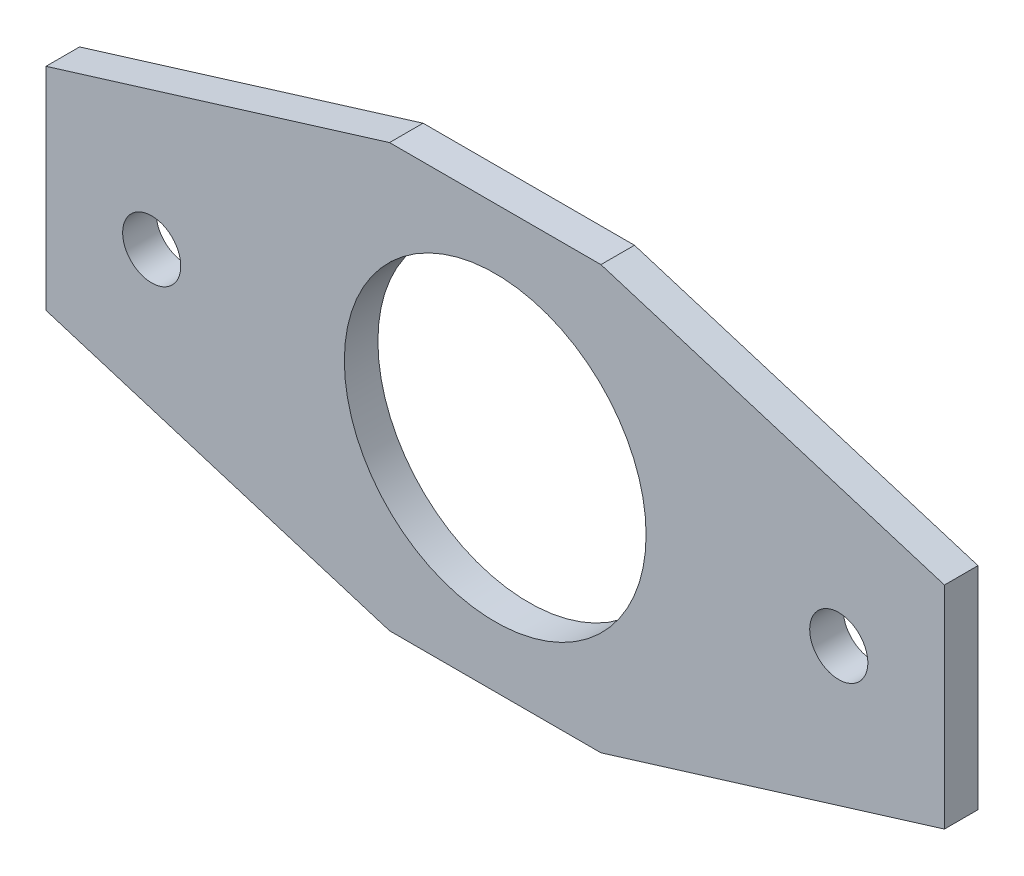
ISO-10303-21;
HEADER;
FILE_DESCRIPTION(('STEP AP214'),'2;1');
FILE_NAME('part.step','',(''),(''),'','','');
FILE_SCHEMA(('AUTOMOTIVE_DESIGN { 1 0 10303 214 1 1 1 1 }'));
ENDSEC;
DATA;
#1=APPLICATION_CONTEXT('core data for automotive mechanical design processes');
#2=APPLICATION_PROTOCOL_DEFINITION('international standard','automotive_design',2000,#1);
#3=PRODUCT_CONTEXT('',#1,'mechanical');
#4=PRODUCT('Part','Part','',(#3));
#5=PRODUCT_RELATED_PRODUCT_CATEGORY('part','',(#4));
#6=PRODUCT_DEFINITION_FORMATION('','',#4);
#7=PRODUCT_DEFINITION_CONTEXT('part definition',#1,'design');
#8=PRODUCT_DEFINITION('design','',#6,#7);
#9=PRODUCT_DEFINITION_SHAPE('','',#8);
#10=(LENGTH_UNIT() NAMED_UNIT(*) SI_UNIT(.MILLI.,.METRE.));
#11=(NAMED_UNIT(*) PLANE_ANGLE_UNIT() SI_UNIT($,.RADIAN.));
#12=(NAMED_UNIT(*) SI_UNIT($,.STERADIAN.) SOLID_ANGLE_UNIT());
#13=UNCERTAINTY_MEASURE_WITH_UNIT(LENGTH_MEASURE(1.E-05),#10,'distance_accuracy_value','');
#14=(GEOMETRIC_REPRESENTATION_CONTEXT(3) GLOBAL_UNCERTAINTY_ASSIGNED_CONTEXT((#13)) GLOBAL_UNIT_ASSIGNED_CONTEXT((#10,
#11,#12)) REPRESENTATION_CONTEXT('',''));
#15=CARTESIAN_POINT('',(0.,0.,0.));
#16=DIRECTION('',(0.,0.,1.));
#17=DIRECTION('',(1.,0.,0.));
#18=AXIS2_PLACEMENT_3D('',#15,#16,#17);
#19=CARTESIAN_POINT('',(0.,0.,3.175));
#20=DIRECTION('',(1.,0.,0.));
#21=DIRECTION('',(0.,0.,-1.));
#22=AXIS2_PLACEMENT_3D('',#19,#20,#21);
#23=PLANE('',#22);
#24=DIRECTION('',(0.,0.,-1.));
#25=VECTOR('',#24,1.);
#26=CARTESIAN_POINT('',(0.,30.,3.175));
#27=LINE('',#26,#25);
#28=CARTESIAN_POINT('',(0.,30.,3.175));
#29=VERTEX_POINT('',#28);
#30=CARTESIAN_POINT('',(0.,30.,0.));
#31=VERTEX_POINT('',#30);
#32=EDGE_CURVE('E130',#29,#31,#27,.T.);
#33=ORIENTED_EDGE('',*,*,#32,.T.);
#34=DIRECTION('',(0.,-1.,0.));
#35=VECTOR('',#34,1.);
#36=CARTESIAN_POINT('',(0.,0.,0.));
#37=LINE('',#36,#35);
#38=CARTESIAN_POINT('',(0.,10.,0.));
#39=VERTEX_POINT('',#38);
#40=EDGE_CURVE('E151',#31,#39,#37,.T.);
#41=ORIENTED_EDGE('',*,*,#40,.T.);
#42=DIRECTION('',(0.,0.,-1.));
#43=VECTOR('',#42,1.);
#44=CARTESIAN_POINT('',(0.,10.,3.175));
#45=LINE('',#44,#43);
#46=CARTESIAN_POINT('',(0.,10.,3.175));
#47=VERTEX_POINT('',#46);
#48=EDGE_CURVE('E136',#47,#39,#45,.T.);
#49=ORIENTED_EDGE('',*,*,#48,.F.);
#50=DIRECTION('',(0.,-1.,0.));
#51=VECTOR('',#50,1.);
#52=CARTESIAN_POINT('',(0.,0.,3.175));
#53=LINE('',#52,#51);
#54=EDGE_CURVE('E153',#29,#47,#53,.T.);
#55=ORIENTED_EDGE('',*,*,#54,.F.);
#56=EDGE_LOOP('',(#33,#41,#49,#55));
#57=FACE_BOUND('',#56,.T.);
#58=ADVANCED_FACE('F40',(#57),#23,.F.);
#59=CARTESIAN_POINT('',(0.,0.,3.175));
#60=DIRECTION('',(0.,1.,0.));
#61=DIRECTION('',(0.,0.,1.));
#62=AXIS2_PLACEMENT_3D('',#59,#60,#61);
#63=PLANE('',#62);
#64=DIRECTION('',(0.,0.,-1.));
#65=VECTOR('',#64,1.);
#66=CARTESIAN_POINT('',(32.5,0.,3.175));
#67=LINE('',#66,#65);
#68=CARTESIAN_POINT('',(32.5,0.,3.175));
#69=VERTEX_POINT('',#68);
#70=CARTESIAN_POINT('',(32.5,0.,0.));
#71=VERTEX_POINT('',#70);
#72=EDGE_CURVE('E142',#69,#71,#67,.T.);
#73=ORIENTED_EDGE('',*,*,#72,.T.);
#74=DIRECTION('',(1.,0.,0.));
#75=VECTOR('',#74,1.);
#76=CARTESIAN_POINT('',(0.,0.,0.));
#77=LINE('',#76,#75);
#78=CARTESIAN_POINT('',(52.5,0.,0.));
#79=VERTEX_POINT('',#78);
#80=EDGE_CURVE('E162',#71,#79,#77,.T.);
#81=ORIENTED_EDGE('',*,*,#80,.T.);
#82=DIRECTION('',(0.,0.,-1.));
#83=VECTOR('',#82,1.);
#84=CARTESIAN_POINT('',(52.5,0.,3.175));
#85=LINE('',#84,#83);
#86=CARTESIAN_POINT('',(52.5,0.,3.175));
#87=VERTEX_POINT('',#86);
#88=EDGE_CURVE('E56',#87,#79,#85,.T.);
#89=ORIENTED_EDGE('',*,*,#88,.F.);
#90=DIRECTION('',(1.,0.,0.));
#91=VECTOR('',#90,1.);
#92=CARTESIAN_POINT('',(0.,0.,3.175));
#93=LINE('',#92,#91);
#94=EDGE_CURVE('E156',#69,#87,#93,.T.);
#95=ORIENTED_EDGE('',*,*,#94,.F.);
#96=EDGE_LOOP('',(#73,#81,#89,#95));
#97=FACE_BOUND('',#96,.T.);
#98=ADVANCED_FACE('F228',(#97),#63,.F.);
#99=CARTESIAN_POINT('',(85.,0.,3.175));
#100=DIRECTION('',(-1.,0.,0.));
#101=DIRECTION('',(0.,0.,1.));
#102=AXIS2_PLACEMENT_3D('',#99,#100,#101);
#103=PLANE('',#102);
#104=DIRECTION('',(0.,0.,-1.));
#105=VECTOR('',#104,1.);
#106=CARTESIAN_POINT('',(85.,10.,3.175));
#107=LINE('',#106,#105);
#108=CARTESIAN_POINT('',(85.,10.,3.175));
#109=VERTEX_POINT('',#108);
#110=CARTESIAN_POINT('',(85.,10.,0.));
#111=VERTEX_POINT('',#110);
#112=EDGE_CURVE('E146',#109,#111,#107,.T.);
#113=ORIENTED_EDGE('',*,*,#112,.T.);
#114=DIRECTION('',(0.,1.,0.));
#115=VECTOR('',#114,1.);
#116=CARTESIAN_POINT('',(85.,0.,0.));
#117=LINE('',#116,#115);
#118=CARTESIAN_POINT('',(85.,30.,0.));
#119=VERTEX_POINT('',#118);
#120=EDGE_CURVE('E164',#111,#119,#117,.T.);
#121=ORIENTED_EDGE('',*,*,#120,.T.);
#122=DIRECTION('',(0.,0.,-1.));
#123=VECTOR('',#122,1.);
#124=CARTESIAN_POINT('',(85.,30.,3.175));
#125=LINE('',#124,#123);
#126=CARTESIAN_POINT('',(85.,30.,3.175));
#127=VERTEX_POINT('',#126);
#128=EDGE_CURVE('E64',#127,#119,#125,.T.);
#129=ORIENTED_EDGE('',*,*,#128,.F.);
#130=DIRECTION('',(0.,1.,0.));
#131=VECTOR('',#130,1.);
#132=CARTESIAN_POINT('',(85.,0.,3.175));
#133=LINE('',#132,#131);
#134=EDGE_CURVE('E48',#109,#127,#133,.T.);
#135=ORIENTED_EDGE('',*,*,#134,.F.);
#136=EDGE_LOOP('',(#113,#121,#129,#135));
#137=FACE_BOUND('',#136,.T.);
#138=ADVANCED_FACE('F168',(#137),#103,.F.);
#139=CARTESIAN_POINT('',(0.,40.,3.175));
#140=DIRECTION('',(0.,-1.,0.));
#141=DIRECTION('',(0.,0.,-1.));
#142=AXIS2_PLACEMENT_3D('',#139,#140,#141);
#143=PLANE('',#142);
#144=DIRECTION('',(0.,0.,-1.));
#145=VECTOR('',#144,1.);
#146=CARTESIAN_POINT('',(32.5,40.,3.175));
#147=LINE('',#146,#145);
#148=CARTESIAN_POINT('',(32.5,40.,3.175));
#149=VERTEX_POINT('',#148);
#150=CARTESIAN_POINT('',(32.5,40.,0.));
#151=VERTEX_POINT('',#150);
#152=EDGE_CURVE('E126',#149,#151,#147,.T.);
#153=ORIENTED_EDGE('',*,*,#152,.F.);
#154=DIRECTION('',(-1.,0.,0.));
#155=VECTOR('',#154,1.);
#156=CARTESIAN_POINT('',(0.,40.,3.175));
#157=LINE('',#156,#155);
#158=CARTESIAN_POINT('',(52.5,40.,3.175));
#159=VERTEX_POINT('',#158);
#160=EDGE_CURVE('E12',#159,#149,#157,.T.);
#161=ORIENTED_EDGE('',*,*,#160,.F.);
#162=DIRECTION('',(0.,0.,-1.));
#163=VECTOR('',#162,1.);
#164=CARTESIAN_POINT('',(52.5,40.,3.175));
#165=LINE('',#164,#163);
#166=CARTESIAN_POINT('',(52.5,40.,0.));
#167=VERTEX_POINT('',#166);
#168=EDGE_CURVE('E104',#159,#167,#165,.T.);
#169=ORIENTED_EDGE('',*,*,#168,.T.);
#170=DIRECTION('',(-1.,0.,0.));
#171=VECTOR('',#170,1.);
#172=CARTESIAN_POINT('',(0.,40.,0.));
#173=LINE('',#172,#171);
#174=EDGE_CURVE('E43',#167,#151,#173,.T.);
#175=ORIENTED_EDGE('',*,*,#174,.T.);
#176=EDGE_LOOP('',(#153,#161,#169,#175));
#177=FACE_BOUND('',#176,.T.);
#178=ADVANCED_FACE('F125',(#177),#143,.F.);
#179=CARTESIAN_POINT('',(0.,0.,3.175));
#180=DIRECTION('',(0.,0.,-1.));
#181=DIRECTION('',(-1.,0.,0.));
#182=AXIS2_PLACEMENT_3D('',#179,#180,#181);
#183=PLANE('',#182);
#184=CARTESIAN_POINT('',(75.,20.,3.175));
#185=DIRECTION('',(0.,0.,-1.));
#186=DIRECTION('',(-1.,0.,0.));
#187=AXIS2_PLACEMENT_3D('',#184,#185,#186);
#188=CIRCLE('',#187,2.75000000000001);
#189=CARTESIAN_POINT('',(72.25,20.,3.175));
#190=VERTEX_POINT('',#189);
#191=EDGE_CURVE('E174',#190,#190,#188,.T.);
#192=ORIENTED_EDGE('',*,*,#191,.T.);
#193=EDGE_LOOP('',(#192));
#194=FACE_BOUND('',#193,.T.);
#195=CARTESIAN_POINT('',(10.,20.,3.175));
#196=DIRECTION('',(0.,0.,-1.));
#197=DIRECTION('',(-1.,0.,0.));
#198=AXIS2_PLACEMENT_3D('',#195,#196,#197);
#199=CIRCLE('',#198,2.75);
#200=CARTESIAN_POINT('',(7.25,20.,3.175));
#201=VERTEX_POINT('',#200);
#202=EDGE_CURVE('E194',#201,#201,#199,.T.);
#203=ORIENTED_EDGE('',*,*,#202,.T.);
#204=EDGE_LOOP('',(#203));
#205=FACE_BOUND('',#204,.T.);
#206=CARTESIAN_POINT('',(42.5,20.,3.175));
#207=DIRECTION('',(0.,0.,1.));
#208=DIRECTION('',(1.,0.,0.));
#209=AXIS2_PLACEMENT_3D('',#206,#207,#208);
#210=CIRCLE('',#209,14.275);
#211=CARTESIAN_POINT('',(56.775,20.,3.175));
#212=VERTEX_POINT('',#211);
#213=EDGE_CURVE('E129',#212,#212,#210,.T.);
#214=ORIENTED_EDGE('',*,*,#213,.F.);
#215=EDGE_LOOP('',(#214));
#216=FACE_BOUND('',#215,.T.);
#217=DIRECTION('',(0.95577900872195,0.294085848837523,0.));
#218=VECTOR('',#217,1.);
#219=CARTESIAN_POINT('',(32.5,40.,3.175));
#220=LINE('',#219,#218);
#221=EDGE_CURVE('E113',#29,#149,#220,.T.);
#222=ORIENTED_EDGE('',*,*,#221,.F.);
#223=ORIENTED_EDGE('',*,*,#54,.T.);
#224=DIRECTION('',(-0.95577900872195,0.294085848837523,0.));
#225=VECTOR('',#224,1.);
#226=CARTESIAN_POINT('',(0.,10.,3.175));
#227=LINE('',#226,#225);
#228=EDGE_CURVE('E189',#69,#47,#227,.T.);
#229=ORIENTED_EDGE('',*,*,#228,.F.);
#230=ORIENTED_EDGE('',*,*,#94,.T.);
#231=DIRECTION('',(-0.95577900872195,-0.294085848837523,0.));
#232=VECTOR('',#231,1.);
#233=CARTESIAN_POINT('',(52.5,0.,3.175));
#234=LINE('',#233,#232);
#235=EDGE_CURVE('E121',#109,#87,#234,.T.);
#236=ORIENTED_EDGE('',*,*,#235,.F.);
#237=ORIENTED_EDGE('',*,*,#134,.T.);
#238=DIRECTION('',(0.95577900872195,-0.294085848837523,0.));
#239=VECTOR('',#238,1.);
#240=CARTESIAN_POINT('',(85.,30.,3.175));
#241=LINE('',#240,#239);
#242=EDGE_CURVE('E107',#159,#127,#241,.T.);
#243=ORIENTED_EDGE('',*,*,#242,.F.);
#244=ORIENTED_EDGE('',*,*,#160,.T.);
#245=EDGE_LOOP('',(#222,#223,#229,#230,#236,#237,#243,#244));
#246=FACE_BOUND('',#245,.T.);
#247=ADVANCED_FACE('F118',(#194,#205,#216,#246),#183,.F.);
#248=CARTESIAN_POINT('',(0.,0.,0.));
#249=DIRECTION('',(0.,0.,-1.));
#250=DIRECTION('',(-1.,0.,0.));
#251=AXIS2_PLACEMENT_3D('',#248,#249,#250);
#252=PLANE('',#251);
#253=CARTESIAN_POINT('',(75.,20.,0.));
#254=DIRECTION('',(0.,0.,-1.));
#255=DIRECTION('',(-1.,0.,0.));
#256=AXIS2_PLACEMENT_3D('',#253,#254,#255);
#257=CIRCLE('',#256,2.75000000000001);
#258=CARTESIAN_POINT('',(72.25,20.,0.));
#259=VERTEX_POINT('',#258);
#260=EDGE_CURVE('E179',#259,#259,#257,.T.);
#261=ORIENTED_EDGE('',*,*,#260,.F.);
#262=EDGE_LOOP('',(#261));
#263=FACE_BOUND('',#262,.T.);
#264=CARTESIAN_POINT('',(10.,20.,0.));
#265=DIRECTION('',(0.,0.,-1.));
#266=DIRECTION('',(-1.,0.,0.));
#267=AXIS2_PLACEMENT_3D('',#264,#265,#266);
#268=CIRCLE('',#267,2.75);
#269=CARTESIAN_POINT('',(7.25,20.,0.));
#270=VERTEX_POINT('',#269);
#271=EDGE_CURVE('E197',#270,#270,#268,.T.);
#272=ORIENTED_EDGE('',*,*,#271,.F.);
#273=EDGE_LOOP('',(#272));
#274=FACE_BOUND('',#273,.T.);
#275=CARTESIAN_POINT('',(42.5,20.,0.));
#276=DIRECTION('',(0.,0.,1.));
#277=DIRECTION('',(1.,0.,0.));
#278=AXIS2_PLACEMENT_3D('',#275,#276,#277);
#279=CIRCLE('',#278,14.275);
#280=CARTESIAN_POINT('',(56.775,20.,0.));
#281=VERTEX_POINT('',#280);
#282=EDGE_CURVE('E133',#281,#281,#279,.T.);
#283=ORIENTED_EDGE('',*,*,#282,.T.);
#284=EDGE_LOOP('',(#283));
#285=FACE_BOUND('',#284,.T.);
#286=ORIENTED_EDGE('',*,*,#40,.F.);
#287=DIRECTION('',(0.95577900872195,0.294085848837523,0.));
#288=VECTOR('',#287,1.);
#289=CARTESIAN_POINT('',(32.5,40.,0.));
#290=LINE('',#289,#288);
#291=EDGE_CURVE('E122',#31,#151,#290,.T.);
#292=ORIENTED_EDGE('',*,*,#291,.T.);
#293=ORIENTED_EDGE('',*,*,#174,.F.);
#294=DIRECTION('',(0.95577900872195,-0.294085848837523,0.));
#295=VECTOR('',#294,1.);
#296=CARTESIAN_POINT('',(85.,30.,0.));
#297=LINE('',#296,#295);
#298=EDGE_CURVE('E108',#167,#119,#297,.T.);
#299=ORIENTED_EDGE('',*,*,#298,.T.);
#300=ORIENTED_EDGE('',*,*,#120,.F.);
#301=DIRECTION('',(-0.95577900872195,-0.294085848837523,0.));
#302=VECTOR('',#301,1.);
#303=CARTESIAN_POINT('',(52.5,0.,0.));
#304=LINE('',#303,#302);
#305=EDGE_CURVE('E173',#111,#79,#304,.T.);
#306=ORIENTED_EDGE('',*,*,#305,.T.);
#307=ORIENTED_EDGE('',*,*,#80,.F.);
#308=DIRECTION('',(-0.95577900872195,0.294085848837523,0.));
#309=VECTOR('',#308,1.);
#310=CARTESIAN_POINT('',(0.,10.,0.));
#311=LINE('',#310,#309);
#312=EDGE_CURVE('E176',#71,#39,#311,.T.);
#313=ORIENTED_EDGE('',*,*,#312,.T.);
#314=EDGE_LOOP('',(#286,#292,#293,#299,#300,#306,#307,#313));
#315=FACE_BOUND('',#314,.T.);
#316=ADVANCED_FACE('F171',(#263,#274,#285,#315),#252,.T.);
#317=CARTESIAN_POINT('',(42.5,20.,0.));
#318=DIRECTION('',(0.,0.,1.));
#319=DIRECTION('',(1.,0.,0.));
#320=AXIS2_PLACEMENT_3D('',#317,#318,#319);
#321=CYLINDRICAL_SURFACE('',#320,14.275);
#322=ORIENTED_EDGE('',*,*,#282,.F.);
#323=EDGE_LOOP('',(#322));
#324=FACE_BOUND('',#323,.T.);
#325=ORIENTED_EDGE('',*,*,#213,.T.);
#326=EDGE_LOOP('',(#325));
#327=FACE_BOUND('',#326,.T.);
#328=ADVANCED_FACE('F207',(#324,#327),#321,.F.);
#329=CARTESIAN_POINT('',(85.,30.,3.175));
#330=DIRECTION('',(0.294085848837523,0.95577900872195,0.));
#331=DIRECTION('',(-0.95577900872195,0.294085848837523,0.));
#332=AXIS2_PLACEMENT_3D('',#329,#330,#331);
#333=PLANE('',#332);
#334=ORIENTED_EDGE('',*,*,#298,.F.);
#335=ORIENTED_EDGE('',*,*,#168,.F.);
#336=ORIENTED_EDGE('',*,*,#242,.T.);
#337=ORIENTED_EDGE('',*,*,#128,.T.);
#338=EDGE_LOOP('',(#334,#335,#336,#337));
#339=FACE_BOUND('',#338,.T.);
#340=ADVANCED_FACE('F106',(#339),#333,.T.);
#341=CARTESIAN_POINT('',(52.5,0.,3.175));
#342=DIRECTION('',(0.294085848837523,-0.95577900872195,0.));
#343=DIRECTION('',(0.95577900872195,0.294085848837523,0.));
#344=AXIS2_PLACEMENT_3D('',#341,#342,#343);
#345=PLANE('',#344);
#346=ORIENTED_EDGE('',*,*,#305,.F.);
#347=ORIENTED_EDGE('',*,*,#112,.F.);
#348=ORIENTED_EDGE('',*,*,#235,.T.);
#349=ORIENTED_EDGE('',*,*,#88,.T.);
#350=EDGE_LOOP('',(#346,#347,#348,#349));
#351=FACE_BOUND('',#350,.T.);
#352=ADVANCED_FACE('F239',(#351),#345,.T.);
#353=CARTESIAN_POINT('',(0.,10.,3.175));
#354=DIRECTION('',(-0.294085848837523,-0.95577900872195,0.));
#355=DIRECTION('',(0.95577900872195,-0.294085848837523,0.));
#356=AXIS2_PLACEMENT_3D('',#353,#354,#355);
#357=PLANE('',#356);
#358=ORIENTED_EDGE('',*,*,#312,.F.);
#359=ORIENTED_EDGE('',*,*,#72,.F.);
#360=ORIENTED_EDGE('',*,*,#228,.T.);
#361=ORIENTED_EDGE('',*,*,#48,.T.);
#362=EDGE_LOOP('',(#358,#359,#360,#361));
#363=FACE_BOUND('',#362,.T.);
#364=ADVANCED_FACE('F237',(#363),#357,.T.);
#365=CARTESIAN_POINT('',(32.5,40.,3.175));
#366=DIRECTION('',(-0.294085848837523,0.95577900872195,0.));
#367=DIRECTION('',(-0.95577900872195,-0.294085848837523,0.));
#368=AXIS2_PLACEMENT_3D('',#365,#366,#367);
#369=PLANE('',#368);
#370=ORIENTED_EDGE('',*,*,#291,.F.);
#371=ORIENTED_EDGE('',*,*,#32,.F.);
#372=ORIENTED_EDGE('',*,*,#221,.T.);
#373=ORIENTED_EDGE('',*,*,#152,.T.);
#374=EDGE_LOOP('',(#370,#371,#372,#373));
#375=FACE_BOUND('',#374,.T.);
#376=ADVANCED_FACE('F184',(#375),#369,.T.);
#377=CARTESIAN_POINT('',(10.,20.,3.175));
#378=DIRECTION('',(0.,0.,-1.));
#379=DIRECTION('',(-1.,0.,0.));
#380=AXIS2_PLACEMENT_3D('',#377,#378,#379);
#381=CYLINDRICAL_SURFACE('',#380,2.75);
#382=ORIENTED_EDGE('',*,*,#202,.F.);
#383=EDGE_LOOP('',(#382));
#384=FACE_BOUND('',#383,.T.);
#385=ORIENTED_EDGE('',*,*,#271,.T.);
#386=EDGE_LOOP('',(#385));
#387=FACE_BOUND('',#386,.T.);
#388=ADVANCED_FACE('F244',(#384,#387),#381,.F.);
#389=CARTESIAN_POINT('',(75.,20.,3.175));
#390=DIRECTION('',(0.,0.,-1.));
#391=DIRECTION('',(-1.,0.,0.));
#392=AXIS2_PLACEMENT_3D('',#389,#390,#391);
#393=CYLINDRICAL_SURFACE('',#392,2.75000000000001);
#394=ORIENTED_EDGE('',*,*,#191,.F.);
#395=EDGE_LOOP('',(#394));
#396=FACE_BOUND('',#395,.T.);
#397=ORIENTED_EDGE('',*,*,#260,.T.);
#398=EDGE_LOOP('',(#397));
#399=FACE_BOUND('',#398,.T.);
#400=ADVANCED_FACE('F203',(#396,#399),#393,.F.);
#401=CLOSED_SHELL('',(#58,#98,#138,#178,#247,#316,#328,#340,#352,#364,#376,#388,#400));
#402=MANIFOLD_SOLID_BREP('B2',#401);
#403=ADVANCED_BREP_SHAPE_REPRESENTATION('',(#18,#402),#14);
#404=SHAPE_DEFINITION_REPRESENTATION(#9,#403);
ENDSEC;
END-ISO-10303-21;
